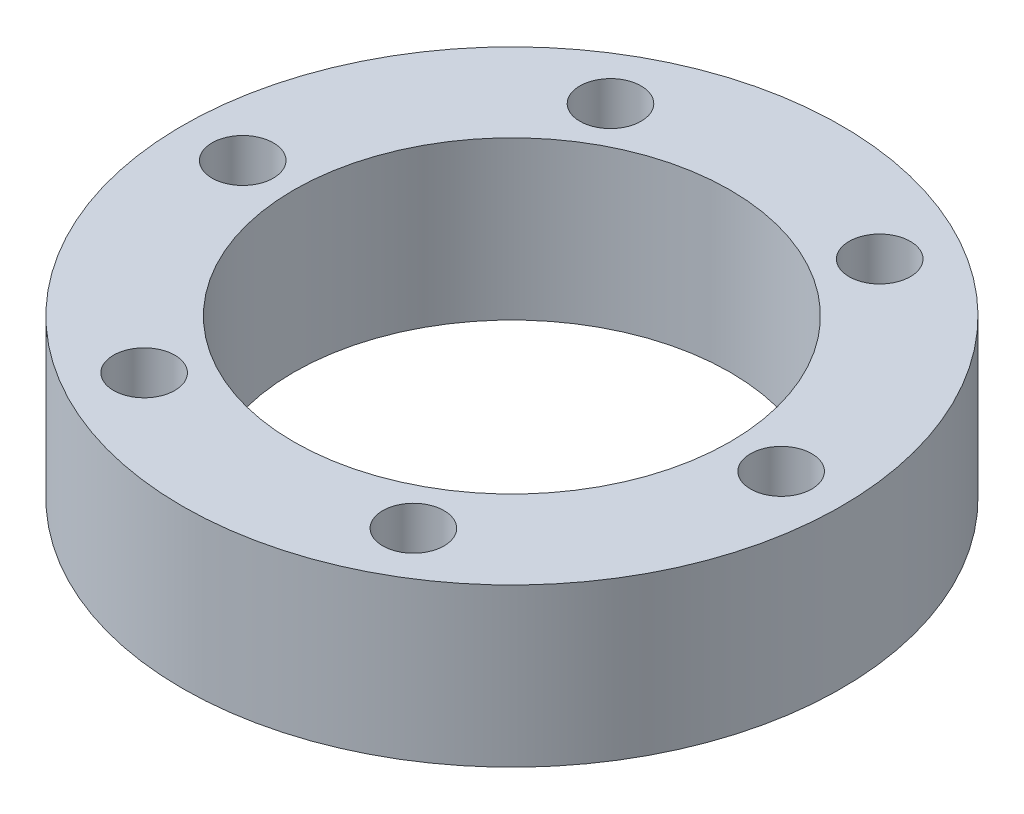
ISO-10303-21;
HEADER;
FILE_DESCRIPTION(('STEP AP214'),'2;1');
FILE_NAME('part.step','',(''),(''),'','','');
FILE_SCHEMA(('AUTOMOTIVE_DESIGN { 1 0 10303 214 1 1 1 1 }'));
ENDSEC;
DATA;
#1=APPLICATION_CONTEXT('core data for automotive mechanical design processes');
#2=APPLICATION_PROTOCOL_DEFINITION('international standard','automotive_design',2000,#1);
#3=PRODUCT_CONTEXT('',#1,'mechanical');
#4=PRODUCT('Part','Part','',(#3));
#5=PRODUCT_RELATED_PRODUCT_CATEGORY('part','',(#4));
#6=PRODUCT_DEFINITION_FORMATION('','',#4);
#7=PRODUCT_DEFINITION_CONTEXT('part definition',#1,'design');
#8=PRODUCT_DEFINITION('design','',#6,#7);
#9=PRODUCT_DEFINITION_SHAPE('','',#8);
#10=(LENGTH_UNIT() NAMED_UNIT(*) SI_UNIT(.MILLI.,.METRE.));
#11=(NAMED_UNIT(*) PLANE_ANGLE_UNIT() SI_UNIT($,.RADIAN.));
#12=(NAMED_UNIT(*) SI_UNIT($,.STERADIAN.) SOLID_ANGLE_UNIT());
#13=UNCERTAINTY_MEASURE_WITH_UNIT(LENGTH_MEASURE(1.E-05),#10,'distance_accuracy_value','');
#14=(GEOMETRIC_REPRESENTATION_CONTEXT(3) GLOBAL_UNCERTAINTY_ASSIGNED_CONTEXT((#13)) GLOBAL_UNIT_ASSIGNED_CONTEXT((#10,
#11,#12)) REPRESENTATION_CONTEXT('',''));
#15=CARTESIAN_POINT('',(0.,0.,0.));
#16=DIRECTION('',(0.,0.,1.));
#17=DIRECTION('',(1.,0.,0.));
#18=AXIS2_PLACEMENT_3D('',#15,#16,#17);
#19=CARTESIAN_POINT('',(0.,17.,0.));
#20=DIRECTION('',(0.,1.,0.));
#21=DIRECTION('',(0.,0.,1.));
#22=AXIS2_PLACEMENT_3D('',#19,#20,#21);
#23=PLANE('',#22);
#24=CARTESIAN_POINT('',(-14.5000000000003,17.,-25.1147367097486));
#25=DIRECTION('',(0.,1.,0.));
#26=DIRECTION('',(0.,0.,1.));
#27=AXIS2_PLACEMENT_3D('',#24,#25,#26);
#28=CIRCLE('',#27,3.29999999999999);
#29=CARTESIAN_POINT('',(-14.5000000000003,17.,-21.8147367097486));
#30=VERTEX_POINT('',#29);
#31=EDGE_CURVE('E83',#30,#30,#28,.T.);
#32=ORIENTED_EDGE('',*,*,#31,.F.);
#33=EDGE_LOOP('',(#32));
#34=FACE_BOUND('',#33,.T.);
#35=CARTESIAN_POINT('',(14.4999999999998,17.,-25.1147367097489));
#36=DIRECTION('',(0.,1.,0.));
#37=DIRECTION('',(0.,0.,1.));
#38=AXIS2_PLACEMENT_3D('',#35,#36,#37);
#39=CIRCLE('',#38,3.29999999999999);
#40=CARTESIAN_POINT('',(14.4999999999998,17.,-21.8147367097489));
#41=VERTEX_POINT('',#40);
#42=EDGE_CURVE('E77',#41,#41,#39,.T.);
#43=ORIENTED_EDGE('',*,*,#42,.F.);
#44=EDGE_LOOP('',(#43));
#45=FACE_BOUND('',#44,.T.);
#46=CARTESIAN_POINT('',(29.,17.,0.));
#47=DIRECTION('',(0.,1.,0.));
#48=DIRECTION('',(0.,0.,1.));
#49=AXIS2_PLACEMENT_3D('',#46,#47,#48);
#50=CIRCLE('',#49,3.29999999999999);
#51=CARTESIAN_POINT('',(29.,17.,3.29999999999999));
#52=VERTEX_POINT('',#51);
#53=EDGE_CURVE('E71',#52,#52,#50,.T.);
#54=ORIENTED_EDGE('',*,*,#53,.F.);
#55=EDGE_LOOP('',(#54));
#56=FACE_BOUND('',#55,.T.);
#57=CARTESIAN_POINT('',(14.5000000000001,17.,25.1147367097487));
#58=DIRECTION('',(0.,1.,0.));
#59=DIRECTION('',(0.,0.,1.));
#60=AXIS2_PLACEMENT_3D('',#57,#58,#59);
#61=CIRCLE('',#60,3.29999999999999);
#62=CARTESIAN_POINT('',(14.5000000000001,17.,28.4147367097486));
#63=VERTEX_POINT('',#62);
#64=EDGE_CURVE('E65',#63,#63,#61,.T.);
#65=ORIENTED_EDGE('',*,*,#64,.F.);
#66=EDGE_LOOP('',(#65));
#67=FACE_BOUND('',#66,.T.);
#68=CARTESIAN_POINT('',(-14.4999999999999,17.,25.1147367097488));
#69=DIRECTION('',(0.,1.,0.));
#70=DIRECTION('',(0.,0.,1.));
#71=AXIS2_PLACEMENT_3D('',#68,#69,#70);
#72=CIRCLE('',#71,3.29999999999999);
#73=CARTESIAN_POINT('',(-14.4999999999999,17.,28.4147367097487));
#74=VERTEX_POINT('',#73);
#75=EDGE_CURVE('E59',#74,#74,#72,.T.);
#76=ORIENTED_EDGE('',*,*,#75,.F.);
#77=EDGE_LOOP('',(#76));
#78=FACE_BOUND('',#77,.T.);
#79=CARTESIAN_POINT('',(-29.,17.,0.));
#80=DIRECTION('',(0.,1.,0.));
#81=DIRECTION('',(0.,0.,1.));
#82=AXIS2_PLACEMENT_3D('',#79,#80,#81);
#83=CIRCLE('',#82,3.29999999999999);
#84=CARTESIAN_POINT('',(-29.,17.,3.29999999999999));
#85=VERTEX_POINT('',#84);
#86=EDGE_CURVE('E53',#85,#85,#83,.T.);
#87=ORIENTED_EDGE('',*,*,#86,.F.);
#88=EDGE_LOOP('',(#87));
#89=FACE_BOUND('',#88,.T.);
#90=CARTESIAN_POINT('',(0.,17.,0.));
#91=DIRECTION('',(0.,1.,0.));
#92=DIRECTION('',(0.,0.,1.));
#93=AXIS2_PLACEMENT_3D('',#90,#91,#92);
#94=CIRCLE('',#93,35.5);
#95=CARTESIAN_POINT('',(0.,17.,35.5));
#96=VERTEX_POINT('',#95);
#97=EDGE_CURVE('E10',#96,#96,#94,.T.);
#98=ORIENTED_EDGE('',*,*,#97,.T.);
#99=EDGE_LOOP('',(#98));
#100=FACE_BOUND('',#99,.T.);
#101=CARTESIAN_POINT('',(0.,17.,0.));
#102=DIRECTION('',(0.,1.,0.));
#103=DIRECTION('',(0.,0.,1.));
#104=AXIS2_PLACEMENT_3D('',#101,#102,#103);
#105=CIRCLE('',#104,23.5);
#106=CARTESIAN_POINT('',(0.,17.,23.5));
#107=VERTEX_POINT('',#106);
#108=EDGE_CURVE('E43',#107,#107,#105,.T.);
#109=ORIENTED_EDGE('',*,*,#108,.F.);
#110=EDGE_LOOP('',(#109));
#111=FACE_BOUND('',#110,.T.);
#112=ADVANCED_FACE('F32',(#34,#45,#56,#67,#78,#89,#100,#111),#23,.T.);
#113=CARTESIAN_POINT('',(0.,0.,0.));
#114=DIRECTION('',(0.,1.,0.));
#115=DIRECTION('',(0.,0.,1.));
#116=AXIS2_PLACEMENT_3D('',#113,#114,#115);
#117=PLANE('',#116);
#118=CARTESIAN_POINT('',(-14.5000000000003,0.,-25.1147367097486));
#119=DIRECTION('',(0.,1.,0.));
#120=DIRECTION('',(0.,0.,1.));
#121=AXIS2_PLACEMENT_3D('',#118,#119,#120);
#122=CIRCLE('',#121,3.29999999999999);
#123=CARTESIAN_POINT('',(-14.5000000000003,0.,-21.8147367097486));
#124=VERTEX_POINT('',#123);
#125=EDGE_CURVE('E80',#124,#124,#122,.T.);
#126=ORIENTED_EDGE('',*,*,#125,.T.);
#127=EDGE_LOOP('',(#126));
#128=FACE_BOUND('',#127,.T.);
#129=CARTESIAN_POINT('',(14.4999999999998,0.,-25.1147367097489));
#130=DIRECTION('',(0.,1.,0.));
#131=DIRECTION('',(0.,0.,1.));
#132=AXIS2_PLACEMENT_3D('',#129,#130,#131);
#133=CIRCLE('',#132,3.29999999999999);
#134=CARTESIAN_POINT('',(14.4999999999998,0.,-21.8147367097489));
#135=VERTEX_POINT('',#134);
#136=EDGE_CURVE('E74',#135,#135,#133,.T.);
#137=ORIENTED_EDGE('',*,*,#136,.T.);
#138=EDGE_LOOP('',(#137));
#139=FACE_BOUND('',#138,.T.);
#140=CARTESIAN_POINT('',(29.,0.,0.));
#141=DIRECTION('',(0.,1.,0.));
#142=DIRECTION('',(0.,0.,1.));
#143=AXIS2_PLACEMENT_3D('',#140,#141,#142);
#144=CIRCLE('',#143,3.29999999999999);
#145=CARTESIAN_POINT('',(29.,0.,3.29999999999999));
#146=VERTEX_POINT('',#145);
#147=EDGE_CURVE('E68',#146,#146,#144,.T.);
#148=ORIENTED_EDGE('',*,*,#147,.T.);
#149=EDGE_LOOP('',(#148));
#150=FACE_BOUND('',#149,.T.);
#151=CARTESIAN_POINT('',(14.5000000000001,0.,25.1147367097487));
#152=DIRECTION('',(0.,1.,0.));
#153=DIRECTION('',(0.,0.,1.));
#154=AXIS2_PLACEMENT_3D('',#151,#152,#153);
#155=CIRCLE('',#154,3.29999999999999);
#156=CARTESIAN_POINT('',(14.5000000000001,0.,28.4147367097487));
#157=VERTEX_POINT('',#156);
#158=EDGE_CURVE('E62',#157,#157,#155,.T.);
#159=ORIENTED_EDGE('',*,*,#158,.T.);
#160=EDGE_LOOP('',(#159));
#161=FACE_BOUND('',#160,.T.);
#162=CARTESIAN_POINT('',(-14.4999999999999,0.,25.1147367097488));
#163=DIRECTION('',(0.,1.,0.));
#164=DIRECTION('',(0.,0.,1.));
#165=AXIS2_PLACEMENT_3D('',#162,#163,#164);
#166=CIRCLE('',#165,3.29999999999999);
#167=CARTESIAN_POINT('',(-14.4999999999999,0.,28.4147367097487));
#168=VERTEX_POINT('',#167);
#169=EDGE_CURVE('E56',#168,#168,#166,.T.);
#170=ORIENTED_EDGE('',*,*,#169,.T.);
#171=EDGE_LOOP('',(#170));
#172=FACE_BOUND('',#171,.T.);
#173=CARTESIAN_POINT('',(-29.,0.,0.));
#174=DIRECTION('',(0.,1.,0.));
#175=DIRECTION('',(0.,0.,1.));
#176=AXIS2_PLACEMENT_3D('',#173,#174,#175);
#177=CIRCLE('',#176,3.29999999999999);
#178=CARTESIAN_POINT('',(-29.,0.,3.29999999999999));
#179=VERTEX_POINT('',#178);
#180=EDGE_CURVE('E48',#179,#179,#177,.T.);
#181=ORIENTED_EDGE('',*,*,#180,.T.);
#182=EDGE_LOOP('',(#181));
#183=FACE_BOUND('',#182,.T.);
#184=CARTESIAN_POINT('',(0.,0.,0.));
#185=DIRECTION('',(0.,1.,0.));
#186=DIRECTION('',(0.,0.,1.));
#187=AXIS2_PLACEMENT_3D('',#184,#185,#186);
#188=CIRCLE('',#187,35.5);
#189=CARTESIAN_POINT('',(0.,0.,35.5));
#190=VERTEX_POINT('',#189);
#191=EDGE_CURVE('E36',#190,#190,#188,.T.);
#192=ORIENTED_EDGE('',*,*,#191,.F.);
#193=EDGE_LOOP('',(#192));
#194=FACE_BOUND('',#193,.T.);
#195=CARTESIAN_POINT('',(0.,0.,0.));
#196=DIRECTION('',(0.,1.,0.));
#197=DIRECTION('',(0.,0.,1.));
#198=AXIS2_PLACEMENT_3D('',#195,#196,#197);
#199=CIRCLE('',#198,23.5);
#200=CARTESIAN_POINT('',(0.,0.,23.5));
#201=VERTEX_POINT('',#200);
#202=EDGE_CURVE('E45',#201,#201,#199,.T.);
#203=ORIENTED_EDGE('',*,*,#202,.T.);
#204=EDGE_LOOP('',(#203));
#205=FACE_BOUND('',#204,.T.);
#206=ADVANCED_FACE('F91',(#128,#139,#150,#161,#172,#183,#194,#205),#117,.F.);
#207=CARTESIAN_POINT('',(0.,17.,0.));
#208=DIRECTION('',(0.,-1.,0.));
#209=DIRECTION('',(0.,0.,-1.));
#210=AXIS2_PLACEMENT_3D('',#207,#208,#209);
#211=CYLINDRICAL_SURFACE('',#210,35.5);
#212=ORIENTED_EDGE('',*,*,#97,.F.);
#213=EDGE_LOOP('',(#212));
#214=FACE_BOUND('',#213,.T.);
#215=ORIENTED_EDGE('',*,*,#191,.T.);
#216=EDGE_LOOP('',(#215));
#217=FACE_BOUND('',#216,.T.);
#218=ADVANCED_FACE('F34',(#214,#217),#211,.T.);
#219=CARTESIAN_POINT('',(0.,17.,0.));
#220=DIRECTION('',(0.,-1.,0.));
#221=DIRECTION('',(0.,0.,-1.));
#222=AXIS2_PLACEMENT_3D('',#219,#220,#221);
#223=CYLINDRICAL_SURFACE('',#222,23.5);
#224=ORIENTED_EDGE('',*,*,#108,.T.);
#225=EDGE_LOOP('',(#224));
#226=FACE_BOUND('',#225,.T.);
#227=ORIENTED_EDGE('',*,*,#202,.F.);
#228=EDGE_LOOP('',(#227));
#229=FACE_BOUND('',#228,.T.);
#230=ADVANCED_FACE('F105',(#226,#229),#223,.F.);
#231=CARTESIAN_POINT('',(-29.,17.,0.));
#232=DIRECTION('',(0.,1.,0.));
#233=DIRECTION('',(0.,0.,1.));
#234=AXIS2_PLACEMENT_3D('',#231,#232,#233);
#235=CYLINDRICAL_SURFACE('',#234,3.29999999999999);
#236=ORIENTED_EDGE('',*,*,#180,.F.);
#237=EDGE_LOOP('',(#236));
#238=FACE_BOUND('',#237,.T.);
#239=ORIENTED_EDGE('',*,*,#86,.T.);
#240=EDGE_LOOP('',(#239));
#241=FACE_BOUND('',#240,.T.);
#242=ADVANCED_FACE('F108',(#238,#241),#235,.F.);
#243=CARTESIAN_POINT('',(-14.4999999999999,17.,25.1147367097488));
#244=DIRECTION('',(0.,1.,0.));
#245=DIRECTION('',(0.,0.,1.));
#246=AXIS2_PLACEMENT_3D('',#243,#244,#245);
#247=CYLINDRICAL_SURFACE('',#246,3.29999999999999);
#248=ORIENTED_EDGE('',*,*,#169,.F.);
#249=EDGE_LOOP('',(#248));
#250=FACE_BOUND('',#249,.T.);
#251=ORIENTED_EDGE('',*,*,#75,.T.);
#252=EDGE_LOOP('',(#251));
#253=FACE_BOUND('',#252,.T.);
#254=ADVANCED_FACE('F122',(#250,#253),#247,.F.);
#255=CARTESIAN_POINT('',(14.5000000000001,17.,25.1147367097487));
#256=DIRECTION('',(0.,1.,0.));
#257=DIRECTION('',(0.,0.,1.));
#258=AXIS2_PLACEMENT_3D('',#255,#256,#257);
#259=CYLINDRICAL_SURFACE('',#258,3.29999999999999);
#260=ORIENTED_EDGE('',*,*,#158,.F.);
#261=EDGE_LOOP('',(#260));
#262=FACE_BOUND('',#261,.T.);
#263=ORIENTED_EDGE('',*,*,#64,.T.);
#264=EDGE_LOOP('',(#263));
#265=FACE_BOUND('',#264,.T.);
#266=ADVANCED_FACE('F126',(#262,#265),#259,.F.);
#267=CARTESIAN_POINT('',(29.,17.,0.));
#268=DIRECTION('',(0.,1.,0.));
#269=DIRECTION('',(0.,0.,1.));
#270=AXIS2_PLACEMENT_3D('',#267,#268,#269);
#271=CYLINDRICAL_SURFACE('',#270,3.29999999999999);
#272=ORIENTED_EDGE('',*,*,#147,.F.);
#273=EDGE_LOOP('',(#272));
#274=FACE_BOUND('',#273,.T.);
#275=ORIENTED_EDGE('',*,*,#53,.T.);
#276=EDGE_LOOP('',(#275));
#277=FACE_BOUND('',#276,.T.);
#278=ADVANCED_FACE('F130',(#274,#277),#271,.F.);
#279=CARTESIAN_POINT('',(14.4999999999998,17.,-25.1147367097489));
#280=DIRECTION('',(0.,1.,0.));
#281=DIRECTION('',(0.,0.,1.));
#282=AXIS2_PLACEMENT_3D('',#279,#280,#281);
#283=CYLINDRICAL_SURFACE('',#282,3.29999999999999);
#284=ORIENTED_EDGE('',*,*,#136,.F.);
#285=EDGE_LOOP('',(#284));
#286=FACE_BOUND('',#285,.T.);
#287=ORIENTED_EDGE('',*,*,#42,.T.);
#288=EDGE_LOOP('',(#287));
#289=FACE_BOUND('',#288,.T.);
#290=ADVANCED_FACE('F134',(#286,#289),#283,.F.);
#291=CARTESIAN_POINT('',(-14.5000000000003,17.,-25.1147367097486));
#292=DIRECTION('',(0.,1.,0.));
#293=DIRECTION('',(0.,0.,1.));
#294=AXIS2_PLACEMENT_3D('',#291,#292,#293);
#295=CYLINDRICAL_SURFACE('',#294,3.29999999999999);
#296=ORIENTED_EDGE('',*,*,#125,.F.);
#297=EDGE_LOOP('',(#296));
#298=FACE_BOUND('',#297,.T.);
#299=ORIENTED_EDGE('',*,*,#31,.T.);
#300=EDGE_LOOP('',(#299));
#301=FACE_BOUND('',#300,.T.);
#302=ADVANCED_FACE('F87',(#298,#301),#295,.F.);
#303=CLOSED_SHELL('',(#112,#206,#218,#230,#242,#254,#266,#278,#290,#302));
#304=MANIFOLD_SOLID_BREP('B2',#303);
#305=ADVANCED_BREP_SHAPE_REPRESENTATION('',(#18,#304),#14);
#306=SHAPE_DEFINITION_REPRESENTATION(#9,#305);
ENDSEC;
END-ISO-10303-21;
